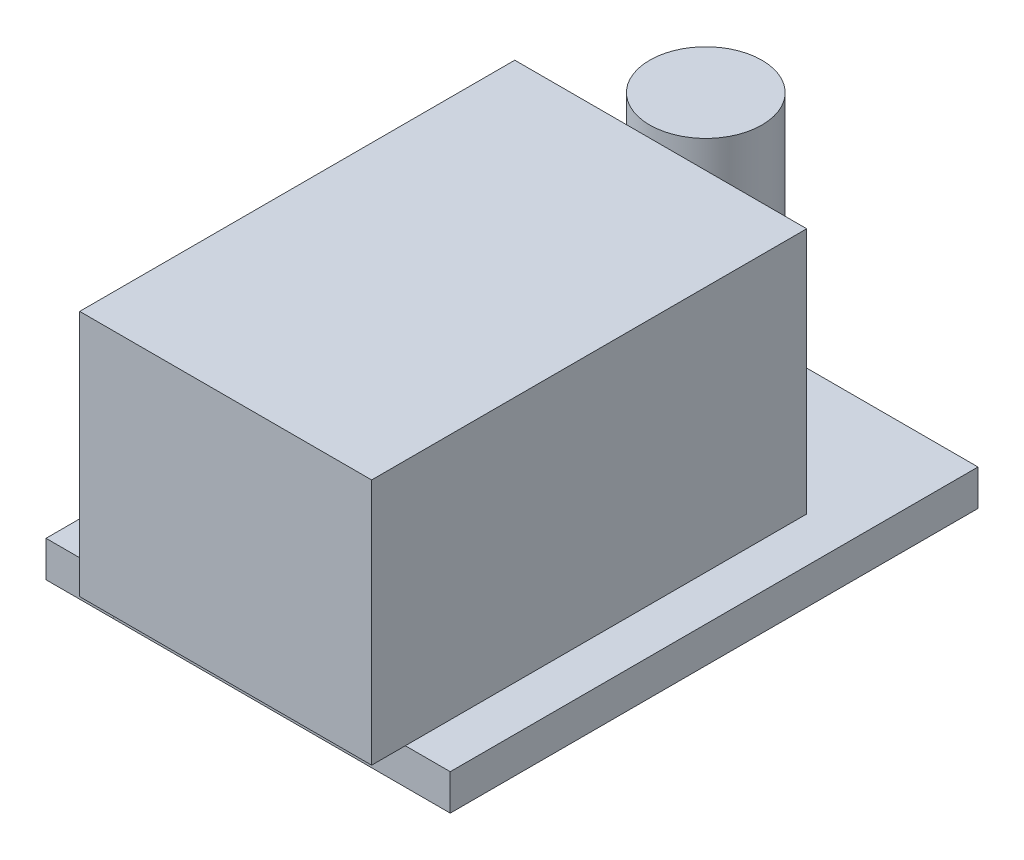
ISO-10303-21;
HEADER;
FILE_DESCRIPTION(('STEP AP214'),'2;1');
FILE_NAME('part.step','',(''),(''),'','','');
FILE_SCHEMA(('AUTOMOTIVE_DESIGN { 1 0 10303 214 1 1 1 1 }'));
ENDSEC;
DATA;
#1=APPLICATION_CONTEXT('core data for automotive mechanical design processes');
#2=APPLICATION_PROTOCOL_DEFINITION('international standard','automotive_design',2000,#1);
#3=PRODUCT_CONTEXT('',#1,'mechanical');
#4=PRODUCT('Part','Part','',(#3));
#5=PRODUCT_RELATED_PRODUCT_CATEGORY('part','',(#4));
#6=PRODUCT_DEFINITION_FORMATION('','',#4);
#7=PRODUCT_DEFINITION_CONTEXT('part definition',#1,'design');
#8=PRODUCT_DEFINITION('design','',#6,#7);
#9=PRODUCT_DEFINITION_SHAPE('','',#8);
#10=(LENGTH_UNIT() NAMED_UNIT(*) SI_UNIT(.MILLI.,.METRE.));
#11=(NAMED_UNIT(*) PLANE_ANGLE_UNIT() SI_UNIT($,.RADIAN.));
#12=(NAMED_UNIT(*) SI_UNIT($,.STERADIAN.) SOLID_ANGLE_UNIT());
#13=UNCERTAINTY_MEASURE_WITH_UNIT(LENGTH_MEASURE(1.E-05),#10,'distance_accuracy_value','');
#14=(GEOMETRIC_REPRESENTATION_CONTEXT(3) GLOBAL_UNCERTAINTY_ASSIGNED_CONTEXT((#13)) GLOBAL_UNIT_ASSIGNED_CONTEXT((#10,
#11,#12)) REPRESENTATION_CONTEXT('',''));
#15=CARTESIAN_POINT('',(0.,0.,0.));
#16=DIRECTION('',(0.,0.,1.));
#17=DIRECTION('',(1.,0.,0.));
#18=AXIS2_PLACEMENT_3D('',#15,#16,#17);
#19=CARTESIAN_POINT('',(0.,-1.6,0.));
#20=DIRECTION('',(0.,-1.,0.));
#21=DIRECTION('',(0.,0.,-1.));
#22=AXIS2_PLACEMENT_3D('',#19,#20,#21);
#23=PLANE('',#22);
#24=DIRECTION('',(0.,0.,-1.));
#25=VECTOR('',#24,1.);
#26=CARTESIAN_POINT('',(-7.5,-1.6,4.25));
#27=LINE('',#26,#25);
#28=CARTESIAN_POINT('',(-7.5,-1.6,11.75));
#29=VERTEX_POINT('',#28);
#30=CARTESIAN_POINT('',(-7.5,-1.6,4.25));
#31=VERTEX_POINT('',#30);
#32=EDGE_CURVE('E54',#29,#31,#27,.T.);
#33=ORIENTED_EDGE('',*,*,#32,.F.);
#34=DIRECTION('',(1.,0.,0.));
#35=VECTOR('',#34,1.);
#36=CARTESIAN_POINT('',(-7.5,-1.6,11.75));
#37=LINE('',#36,#35);
#38=CARTESIAN_POINT('',(-10.5,-1.6,11.75));
#39=VERTEX_POINT('',#38);
#40=EDGE_CURVE('E77',#39,#29,#37,.T.);
#41=ORIENTED_EDGE('',*,*,#40,.F.);
#42=DIRECTION('',(0.,0.,1.));
#43=VECTOR('',#42,1.);
#44=CARTESIAN_POINT('',(-10.5,-1.6,4.25));
#45=LINE('',#44,#43);
#46=CARTESIAN_POINT('',(-10.5,-1.6,4.25));
#47=VERTEX_POINT('',#46);
#48=EDGE_CURVE('E82',#47,#39,#45,.T.);
#49=ORIENTED_EDGE('',*,*,#48,.F.);
#50=DIRECTION('',(-1.,0.,0.));
#51=VECTOR('',#50,1.);
#52=CARTESIAN_POINT('',(-7.5,-1.6,4.25));
#53=LINE('',#52,#51);
#54=EDGE_CURVE('E97',#31,#47,#53,.T.);
#55=ORIENTED_EDGE('',*,*,#54,.F.);
#56=EDGE_LOOP('',(#33,#41,#49,#55));
#57=FACE_BOUND('',#56,.T.);
#58=ADVANCED_FACE('F46',(#57),#23,.T.);
#59=CARTESIAN_POINT('',(0.,0.,0.));
#60=DIRECTION('',(0.,-1.,0.));
#61=DIRECTION('',(0.,0.,-1.));
#62=AXIS2_PLACEMENT_3D('',#59,#60,#61);
#63=PLANE('',#62);
#64=DIRECTION('',(0.,0.,-1.));
#65=VECTOR('',#64,1.);
#66=CARTESIAN_POINT('',(-7.5,0.,4.25));
#67=LINE('',#66,#65);
#68=CARTESIAN_POINT('',(-7.5,0.,11.75));
#69=VERTEX_POINT('',#68);
#70=CARTESIAN_POINT('',(-7.5,0.,4.25));
#71=VERTEX_POINT('',#70);
#72=EDGE_CURVE('E106',#69,#71,#67,.T.);
#73=ORIENTED_EDGE('',*,*,#72,.T.);
#74=DIRECTION('',(-1.,0.,0.));
#75=VECTOR('',#74,1.);
#76=CARTESIAN_POINT('',(-7.5,0.,4.25));
#77=LINE('',#76,#75);
#78=CARTESIAN_POINT('',(-10.5,0.,4.25));
#79=VERTEX_POINT('',#78);
#80=EDGE_CURVE('E95',#71,#79,#77,.T.);
#81=ORIENTED_EDGE('',*,*,#80,.T.);
#82=DIRECTION('',(0.,0.,1.));
#83=VECTOR('',#82,1.);
#84=CARTESIAN_POINT('',(-10.5,0.,4.25));
#85=LINE('',#84,#83);
#86=CARTESIAN_POINT('',(-10.5,0.,11.75));
#87=VERTEX_POINT('',#86);
#88=EDGE_CURVE('E98',#79,#87,#85,.T.);
#89=ORIENTED_EDGE('',*,*,#88,.T.);
#90=DIRECTION('',(1.,0.,0.));
#91=VECTOR('',#90,1.);
#92=CARTESIAN_POINT('',(-7.5,0.,11.75));
#93=LINE('',#92,#91);
#94=EDGE_CURVE('E103',#87,#69,#93,.T.);
#95=ORIENTED_EDGE('',*,*,#94,.T.);
#96=EDGE_LOOP('',(#73,#81,#89,#95));
#97=FACE_BOUND('',#96,.T.);
#98=ADVANCED_FACE('F105',(#97),#63,.F.);
#99=CARTESIAN_POINT('',(-7.5,-9.67774721070175,4.25));
#100=DIRECTION('',(0.,0.,-1.));
#101=DIRECTION('',(-1.,0.,0.));
#102=AXIS2_PLACEMENT_3D('',#99,#100,#101);
#103=PLANE('',#102);
#104=DIRECTION('',(0.,1.,0.));
#105=VECTOR('',#104,1.);
#106=CARTESIAN_POINT('',(-7.5,-9.67774721070175,4.25));
#107=LINE('',#106,#105);
#108=EDGE_CURVE('E12',#31,#71,#107,.T.);
#109=ORIENTED_EDGE('',*,*,#108,.F.);
#110=ORIENTED_EDGE('',*,*,#54,.T.);
#111=DIRECTION('',(0.,1.,0.));
#112=VECTOR('',#111,1.);
#113=CARTESIAN_POINT('',(-10.5,-9.67774721070175,4.25));
#114=LINE('',#113,#112);
#115=EDGE_CURVE('E92',#47,#79,#114,.T.);
#116=ORIENTED_EDGE('',*,*,#115,.T.);
#117=ORIENTED_EDGE('',*,*,#80,.F.);
#118=EDGE_LOOP('',(#109,#110,#116,#117));
#119=FACE_BOUND('',#118,.T.);
#120=ADVANCED_FACE('F93',(#119),#103,.T.);
#121=CARTESIAN_POINT('',(-10.5,-9.67774721070175,4.25));
#122=DIRECTION('',(-1.,0.,0.));
#123=DIRECTION('',(0.,0.,1.));
#124=AXIS2_PLACEMENT_3D('',#121,#122,#123);
#125=PLANE('',#124);
#126=ORIENTED_EDGE('',*,*,#115,.F.);
#127=ORIENTED_EDGE('',*,*,#48,.T.);
#128=DIRECTION('',(0.,1.,0.));
#129=VECTOR('',#128,1.);
#130=CARTESIAN_POINT('',(-10.5,-9.67774721070175,11.75));
#131=LINE('',#130,#129);
#132=EDGE_CURVE('E87',#39,#87,#131,.T.);
#133=ORIENTED_EDGE('',*,*,#132,.T.);
#134=ORIENTED_EDGE('',*,*,#88,.F.);
#135=EDGE_LOOP('',(#126,#127,#133,#134));
#136=FACE_BOUND('',#135,.T.);
#137=ADVANCED_FACE('F99',(#136),#125,.T.);
#138=CARTESIAN_POINT('',(-7.5,-9.67774721070175,11.75));
#139=DIRECTION('',(0.,0.,1.));
#140=DIRECTION('',(1.,0.,0.));
#141=AXIS2_PLACEMENT_3D('',#138,#139,#140);
#142=PLANE('',#141);
#143=ORIENTED_EDGE('',*,*,#132,.F.);
#144=ORIENTED_EDGE('',*,*,#40,.T.);
#145=DIRECTION('',(0.,1.,0.));
#146=VECTOR('',#145,1.);
#147=CARTESIAN_POINT('',(-7.5,-9.67774721070175,11.75));
#148=LINE('',#147,#146);
#149=EDGE_CURVE('E113',#29,#69,#148,.T.);
#150=ORIENTED_EDGE('',*,*,#149,.T.);
#151=ORIENTED_EDGE('',*,*,#94,.F.);
#152=EDGE_LOOP('',(#143,#144,#150,#151));
#153=FACE_BOUND('',#152,.T.);
#154=ADVANCED_FACE('F119',(#153),#142,.T.);
#155=CARTESIAN_POINT('',(-7.5,-9.67774721070175,4.25));
#156=DIRECTION('',(1.,0.,0.));
#157=DIRECTION('',(0.,0.,-1.));
#158=AXIS2_PLACEMENT_3D('',#155,#156,#157);
#159=PLANE('',#158);
#160=ORIENTED_EDGE('',*,*,#149,.F.);
#161=ORIENTED_EDGE('',*,*,#32,.T.);
#162=ORIENTED_EDGE('',*,*,#108,.T.);
#163=ORIENTED_EDGE('',*,*,#72,.F.);
#164=EDGE_LOOP('',(#160,#161,#162,#163));
#165=FACE_BOUND('',#164,.T.);
#166=ADVANCED_FACE('F120',(#165),#159,.T.);
#167=CLOSED_SHELL('',(#58,#98,#120,#137,#154,#166));
#168=MANIFOLD_SOLID_BREP('B2',#167);
#169=CARTESIAN_POINT('',(0.,-1.6,0.));
#170=DIRECTION('',(0.,-1.,0.));
#171=DIRECTION('',(0.,0.,-1.));
#172=AXIS2_PLACEMENT_3D('',#169,#170,#171);
#173=PLANE('',#172);
#174=DIRECTION('',(0.,0.,-1.));
#175=VECTOR('',#174,1.);
#176=CARTESIAN_POINT('',(-7.5,-1.6,-10.85));
#177=LINE('',#176,#175);
#178=CARTESIAN_POINT('',(-7.5,-1.6,-6.35));
#179=VERTEX_POINT('',#178);
#180=CARTESIAN_POINT('',(-7.5,-1.6,-10.85));
#181=VERTEX_POINT('',#180);
#182=EDGE_CURVE('E187',#179,#181,#177,.T.);
#183=ORIENTED_EDGE('',*,*,#182,.F.);
#184=DIRECTION('',(1.,0.,0.));
#185=VECTOR('',#184,1.);
#186=CARTESIAN_POINT('',(-7.5,-1.6,-6.35));
#187=LINE('',#186,#185);
#188=CARTESIAN_POINT('',(-10.5,-1.6,-6.35));
#189=VERTEX_POINT('',#188);
#190=EDGE_CURVE('E210',#189,#179,#187,.T.);
#191=ORIENTED_EDGE('',*,*,#190,.F.);
#192=DIRECTION('',(0.,0.,1.));
#193=VECTOR('',#192,1.);
#194=CARTESIAN_POINT('',(-10.5,-1.6,-10.85));
#195=LINE('',#194,#193);
#196=CARTESIAN_POINT('',(-10.5,-1.6,-10.85));
#197=VERTEX_POINT('',#196);
#198=EDGE_CURVE('E215',#197,#189,#195,.T.);
#199=ORIENTED_EDGE('',*,*,#198,.F.);
#200=DIRECTION('',(-1.,0.,0.));
#201=VECTOR('',#200,1.);
#202=CARTESIAN_POINT('',(-7.5,-1.6,-10.85));
#203=LINE('',#202,#201);
#204=EDGE_CURVE('E230',#181,#197,#203,.T.);
#205=ORIENTED_EDGE('',*,*,#204,.F.);
#206=EDGE_LOOP('',(#183,#191,#199,#205));
#207=FACE_BOUND('',#206,.T.);
#208=ADVANCED_FACE('F179',(#207),#173,.T.);
#209=CARTESIAN_POINT('',(0.,0.,0.));
#210=DIRECTION('',(0.,-1.,0.));
#211=DIRECTION('',(0.,0.,-1.));
#212=AXIS2_PLACEMENT_3D('',#209,#210,#211);
#213=PLANE('',#212);
#214=DIRECTION('',(0.,0.,-1.));
#215=VECTOR('',#214,1.);
#216=CARTESIAN_POINT('',(-7.5,0.,-10.85));
#217=LINE('',#216,#215);
#218=CARTESIAN_POINT('',(-7.5,0.,-6.35));
#219=VERTEX_POINT('',#218);
#220=CARTESIAN_POINT('',(-7.5,0.,-10.85));
#221=VERTEX_POINT('',#220);
#222=EDGE_CURVE('E239',#219,#221,#217,.T.);
#223=ORIENTED_EDGE('',*,*,#222,.T.);
#224=DIRECTION('',(-1.,0.,0.));
#225=VECTOR('',#224,1.);
#226=CARTESIAN_POINT('',(-7.5,0.,-10.85));
#227=LINE('',#226,#225);
#228=CARTESIAN_POINT('',(-10.5,0.,-10.85));
#229=VERTEX_POINT('',#228);
#230=EDGE_CURVE('E228',#221,#229,#227,.T.);
#231=ORIENTED_EDGE('',*,*,#230,.T.);
#232=DIRECTION('',(0.,0.,1.));
#233=VECTOR('',#232,1.);
#234=CARTESIAN_POINT('',(-10.5,0.,-10.85));
#235=LINE('',#234,#233);
#236=CARTESIAN_POINT('',(-10.5,0.,-6.35));
#237=VERTEX_POINT('',#236);
#238=EDGE_CURVE('E231',#229,#237,#235,.T.);
#239=ORIENTED_EDGE('',*,*,#238,.T.);
#240=DIRECTION('',(1.,0.,0.));
#241=VECTOR('',#240,1.);
#242=CARTESIAN_POINT('',(-7.5,0.,-6.35));
#243=LINE('',#242,#241);
#244=EDGE_CURVE('E236',#237,#219,#243,.T.);
#245=ORIENTED_EDGE('',*,*,#244,.T.);
#246=EDGE_LOOP('',(#223,#231,#239,#245));
#247=FACE_BOUND('',#246,.T.);
#248=ADVANCED_FACE('F238',(#247),#213,.F.);
#249=CARTESIAN_POINT('',(-7.5,-9.67774721070175,-10.85));
#250=DIRECTION('',(0.,0.,-1.));
#251=DIRECTION('',(-1.,0.,0.));
#252=AXIS2_PLACEMENT_3D('',#249,#250,#251);
#253=PLANE('',#252);
#254=DIRECTION('',(0.,1.,0.));
#255=VECTOR('',#254,1.);
#256=CARTESIAN_POINT('',(-7.5,-9.67774721070175,-10.85));
#257=LINE('',#256,#255);
#258=EDGE_CURVE('E44',#181,#221,#257,.T.);
#259=ORIENTED_EDGE('',*,*,#258,.F.);
#260=ORIENTED_EDGE('',*,*,#204,.T.);
#261=DIRECTION('',(0.,1.,0.));
#262=VECTOR('',#261,1.);
#263=CARTESIAN_POINT('',(-10.5,-9.67774721070175,-10.85));
#264=LINE('',#263,#262);
#265=EDGE_CURVE('E225',#197,#229,#264,.T.);
#266=ORIENTED_EDGE('',*,*,#265,.T.);
#267=ORIENTED_EDGE('',*,*,#230,.F.);
#268=EDGE_LOOP('',(#259,#260,#266,#267));
#269=FACE_BOUND('',#268,.T.);
#270=ADVANCED_FACE('F226',(#269),#253,.T.);
#271=CARTESIAN_POINT('',(-10.5,-9.67774721070175,-10.85));
#272=DIRECTION('',(-1.,0.,0.));
#273=DIRECTION('',(0.,0.,1.));
#274=AXIS2_PLACEMENT_3D('',#271,#272,#273);
#275=PLANE('',#274);
#276=ORIENTED_EDGE('',*,*,#265,.F.);
#277=ORIENTED_EDGE('',*,*,#198,.T.);
#278=DIRECTION('',(0.,1.,0.));
#279=VECTOR('',#278,1.);
#280=CARTESIAN_POINT('',(-10.5,-9.67774721070175,-6.35));
#281=LINE('',#280,#279);
#282=EDGE_CURVE('E220',#189,#237,#281,.T.);
#283=ORIENTED_EDGE('',*,*,#282,.T.);
#284=ORIENTED_EDGE('',*,*,#238,.F.);
#285=EDGE_LOOP('',(#276,#277,#283,#284));
#286=FACE_BOUND('',#285,.T.);
#287=ADVANCED_FACE('F232',(#286),#275,.T.);
#288=CARTESIAN_POINT('',(-7.5,-9.67774721070175,-6.35));
#289=DIRECTION('',(0.,0.,1.));
#290=DIRECTION('',(1.,0.,0.));
#291=AXIS2_PLACEMENT_3D('',#288,#289,#290);
#292=PLANE('',#291);
#293=ORIENTED_EDGE('',*,*,#282,.F.);
#294=ORIENTED_EDGE('',*,*,#190,.T.);
#295=DIRECTION('',(0.,1.,0.));
#296=VECTOR('',#295,1.);
#297=CARTESIAN_POINT('',(-7.5,-9.67774721070175,-6.35));
#298=LINE('',#297,#296);
#299=EDGE_CURVE('E246',#179,#219,#298,.T.);
#300=ORIENTED_EDGE('',*,*,#299,.T.);
#301=ORIENTED_EDGE('',*,*,#244,.F.);
#302=EDGE_LOOP('',(#293,#294,#300,#301));
#303=FACE_BOUND('',#302,.T.);
#304=ADVANCED_FACE('F252',(#303),#292,.T.);
#305=CARTESIAN_POINT('',(-7.5,-9.67774721070175,-10.85));
#306=DIRECTION('',(1.,0.,0.));
#307=DIRECTION('',(0.,0.,-1.));
#308=AXIS2_PLACEMENT_3D('',#305,#306,#307);
#309=PLANE('',#308);
#310=ORIENTED_EDGE('',*,*,#299,.F.);
#311=ORIENTED_EDGE('',*,*,#182,.T.);
#312=ORIENTED_EDGE('',*,*,#258,.T.);
#313=ORIENTED_EDGE('',*,*,#222,.F.);
#314=EDGE_LOOP('',(#310,#311,#312,#313));
#315=FACE_BOUND('',#314,.T.);
#316=ADVANCED_FACE('F253',(#315),#309,.T.);
#317=CLOSED_SHELL('',(#208,#248,#270,#287,#304,#316));
#318=MANIFOLD_SOLID_BREP('B6',#317);
#319=CARTESIAN_POINT('',(0.,0.,0.));
#320=DIRECTION('',(0.,-1.,0.));
#321=DIRECTION('',(0.,0.,-1.));
#322=AXIS2_PLACEMENT_3D('',#319,#320,#321);
#323=PLANE('',#322);
#324=CARTESIAN_POINT('',(-1.99707729388541,0.,-9.12718520474696));
#325=DIRECTION('',(0.,-1.,0.));
#326=DIRECTION('',(0.,0.,-1.));
#327=AXIS2_PLACEMENT_3D('',#324,#325,#326);
#328=CIRCLE('',#327,2.5);
#329=CARTESIAN_POINT('',(-1.99707729388541,0.,-11.627185204747));
#330=VERTEX_POINT('',#329);
#331=EDGE_CURVE('E177',#330,#330,#328,.F.);
#332=ORIENTED_EDGE('',*,*,#331,.F.);
#333=EDGE_LOOP('',(#332));
#334=FACE_BOUND('',#333,.T.);
#335=DIRECTION('',(-1.,0.,0.));
#336=VECTOR('',#335,1.);
#337=CARTESIAN_POINT('',(-7.5,0.,-6.12356921616279));
#338=LINE('',#337,#336);
#339=CARTESIAN_POINT('',(5.5,0.,-6.12356921616279));
#340=VERTEX_POINT('',#339);
#341=CARTESIAN_POINT('',(-7.5,0.,-6.1235692161628));
#342=VERTEX_POINT('',#341);
#343=EDGE_CURVE('E389',#340,#342,#338,.T.);
#344=ORIENTED_EDGE('',*,*,#343,.F.);
#345=DIRECTION('',(0.,0.,-1.));
#346=VECTOR('',#345,1.);
#347=CARTESIAN_POINT('',(5.5,0.,13.25));
#348=LINE('',#347,#346);
#349=CARTESIAN_POINT('',(5.5,0.,11.75));
#350=VERTEX_POINT('',#349);
#351=EDGE_CURVE('E311',#350,#340,#348,.T.);
#352=ORIENTED_EDGE('',*,*,#351,.F.);
#353=DIRECTION('',(1.,0.,0.));
#354=VECTOR('',#353,1.);
#355=CARTESIAN_POINT('',(-7.5,0.,11.75));
#356=LINE('',#355,#354);
#357=CARTESIAN_POINT('',(7.5,0.,11.75));
#358=VERTEX_POINT('',#357);
#359=EDGE_CURVE('E395',#350,#358,#356,.T.);
#360=ORIENTED_EDGE('',*,*,#359,.T.);
#361=DIRECTION('',(0.,0.,-1.));
#362=VECTOR('',#361,1.);
#363=CARTESIAN_POINT('',(7.5,0.,11.75));
#364=LINE('',#363,#362);
#365=CARTESIAN_POINT('',(7.5,0.,-11.75));
#366=VERTEX_POINT('',#365);
#367=EDGE_CURVE('E418',#358,#366,#364,.T.);
#368=ORIENTED_EDGE('',*,*,#367,.T.);
#369=DIRECTION('',(-1.,0.,0.));
#370=VECTOR('',#369,1.);
#371=CARTESIAN_POINT('',(-7.5,0.,-11.75));
#372=LINE('',#371,#370);
#373=CARTESIAN_POINT('',(-7.5,0.,-11.75));
#374=VERTEX_POINT('',#373);
#375=EDGE_CURVE('E405',#366,#374,#372,.T.);
#376=ORIENTED_EDGE('',*,*,#375,.T.);
#377=DIRECTION('',(0.,0.,1.));
#378=VECTOR('',#377,1.);
#379=CARTESIAN_POINT('',(-7.5,0.,11.75));
#380=LINE('',#379,#378);
#381=EDGE_CURVE('E323',#374,#342,#380,.T.);
#382=ORIENTED_EDGE('',*,*,#381,.T.);
#383=EDGE_LOOP('',(#344,#352,#360,#368,#376,#382));
#384=FACE_BOUND('',#383,.T.);
#385=ADVANCED_FACE('F303',(#334,#384),#323,.F.);
#386=CARTESIAN_POINT('',(-7.5,-1.6,11.75));
#387=DIRECTION('',(-1.,0.,0.));
#388=DIRECTION('',(0.,0.,1.));
#389=AXIS2_PLACEMENT_3D('',#386,#387,#388);
#390=PLANE('',#389);
#391=ORIENTED_EDGE('',*,*,#381,.F.);
#392=DIRECTION('',(0.,1.,0.));
#393=VECTOR('',#392,1.);
#394=CARTESIAN_POINT('',(-7.5,-1.6,-11.75));
#395=LINE('',#394,#393);
#396=CARTESIAN_POINT('',(-7.5,-1.6,-11.75));
#397=VERTEX_POINT('',#396);
#398=EDGE_CURVE('E422',#397,#374,#395,.T.);
#399=ORIENTED_EDGE('',*,*,#398,.F.);
#400=DIRECTION('',(0.,0.,1.));
#401=VECTOR('',#400,1.);
#402=CARTESIAN_POINT('',(-7.5,-1.6,11.75));
#403=LINE('',#402,#401);
#404=CARTESIAN_POINT('',(-7.5,-1.6,11.75));
#405=VERTEX_POINT('',#404);
#406=EDGE_CURVE('E401',#397,#405,#403,.T.);
#407=ORIENTED_EDGE('',*,*,#406,.T.);
#408=DIRECTION('',(0.,1.,0.));
#409=VECTOR('',#408,1.);
#410=CARTESIAN_POINT('',(-7.5,-1.6,11.75));
#411=LINE('',#410,#409);
#412=CARTESIAN_POINT('',(-7.5,0.,11.75));
#413=VERTEX_POINT('',#412);
#414=EDGE_CURVE('E413',#405,#413,#411,.T.);
#415=ORIENTED_EDGE('',*,*,#414,.T.);
#416=DIRECTION('',(0.,0.,1.));
#417=VECTOR('',#416,1.);
#418=CARTESIAN_POINT('',(-7.5,0.,13.25));
#419=LINE('',#418,#417);
#420=CARTESIAN_POINT('',(-7.5,0.,13.25));
#421=VERTEX_POINT('',#420);
#422=EDGE_CURVE('E392',#413,#421,#419,.T.);
#423=ORIENTED_EDGE('',*,*,#422,.T.);
#424=DIRECTION('',(0.,-1.,0.));
#425=VECTOR('',#424,1.);
#426=CARTESIAN_POINT('',(-7.5,11.,13.25));
#427=LINE('',#426,#425);
#428=CARTESIAN_POINT('',(-7.5,11.,13.25));
#429=VERTEX_POINT('',#428);
#430=EDGE_CURVE('E374',#429,#421,#427,.T.);
#431=ORIENTED_EDGE('',*,*,#430,.F.);
#432=DIRECTION('',(0.,0.,1.));
#433=VECTOR('',#432,1.);
#434=CARTESIAN_POINT('',(-7.5,11.,13.25));
#435=LINE('',#434,#433);
#436=CARTESIAN_POINT('',(-7.5,11.,-6.12356921616279));
#437=VERTEX_POINT('',#436);
#438=EDGE_CURVE('E380',#437,#429,#435,.T.);
#439=ORIENTED_EDGE('',*,*,#438,.F.);
#440=DIRECTION('',(0.,-1.,0.));
#441=VECTOR('',#440,1.);
#442=CARTESIAN_POINT('',(-7.5,11.,-6.12356921616279));
#443=LINE('',#442,#441);
#444=EDGE_CURVE('E449',#437,#342,#443,.T.);
#445=ORIENTED_EDGE('',*,*,#444,.T.);
#446=EDGE_LOOP('',(#391,#399,#407,#415,#423,#431,#439,#445));
#447=FACE_BOUND('',#446,.T.);
#448=ADVANCED_FACE('F305',(#447),#390,.T.);
#449=CARTESIAN_POINT('',(-7.5,-1.6,-11.75));
#450=DIRECTION('',(0.,0.,-1.));
#451=DIRECTION('',(-1.,0.,0.));
#452=AXIS2_PLACEMENT_3D('',#449,#450,#451);
#453=PLANE('',#452);
#454=ORIENTED_EDGE('',*,*,#375,.F.);
#455=DIRECTION('',(0.,1.,0.));
#456=VECTOR('',#455,1.);
#457=CARTESIAN_POINT('',(7.5,-1.6,-11.75));
#458=LINE('',#457,#456);
#459=CARTESIAN_POINT('',(7.5,-1.6,-11.75));
#460=VERTEX_POINT('',#459);
#461=EDGE_CURVE('E424',#460,#366,#458,.T.);
#462=ORIENTED_EDGE('',*,*,#461,.F.);
#463=DIRECTION('',(-1.,0.,0.));
#464=VECTOR('',#463,1.);
#465=CARTESIAN_POINT('',(-7.5,-1.6,-11.75));
#466=LINE('',#465,#464);
#467=EDGE_CURVE('E411',#460,#397,#466,.T.);
#468=ORIENTED_EDGE('',*,*,#467,.T.);
#469=ORIENTED_EDGE('',*,*,#398,.T.);
#470=EDGE_LOOP('',(#454,#462,#468,#469));
#471=FACE_BOUND('',#470,.T.);
#472=ADVANCED_FACE('F471',(#471),#453,.T.);
#473=CARTESIAN_POINT('',(7.5,-1.6,11.75));
#474=DIRECTION('',(1.,0.,0.));
#475=DIRECTION('',(0.,0.,-1.));
#476=AXIS2_PLACEMENT_3D('',#473,#474,#475);
#477=PLANE('',#476);
#478=ORIENTED_EDGE('',*,*,#367,.F.);
#479=DIRECTION('',(0.,1.,0.));
#480=VECTOR('',#479,1.);
#481=CARTESIAN_POINT('',(7.5,-1.6,11.75));
#482=LINE('',#481,#480);
#483=CARTESIAN_POINT('',(7.5,-1.6,11.75));
#484=VERTEX_POINT('',#483);
#485=EDGE_CURVE('E426',#484,#358,#482,.T.);
#486=ORIENTED_EDGE('',*,*,#485,.F.);
#487=DIRECTION('',(0.,0.,-1.));
#488=VECTOR('',#487,1.);
#489=CARTESIAN_POINT('',(7.5,-1.6,11.75));
#490=LINE('',#489,#488);
#491=EDGE_CURVE('E408',#484,#460,#490,.T.);
#492=ORIENTED_EDGE('',*,*,#491,.T.);
#493=ORIENTED_EDGE('',*,*,#461,.T.);
#494=EDGE_LOOP('',(#478,#486,#492,#493));
#495=FACE_BOUND('',#494,.T.);
#496=ADVANCED_FACE('F477',(#495),#477,.T.);
#497=CARTESIAN_POINT('',(-7.5,-1.6,11.75));
#498=DIRECTION('',(0.,0.,1.));
#499=DIRECTION('',(1.,0.,0.));
#500=AXIS2_PLACEMENT_3D('',#497,#498,#499);
#501=PLANE('',#500);
#502=EDGE_CURVE('E415',#413,#350,#356,.T.);
#503=ORIENTED_EDGE('',*,*,#502,.F.);
#504=ORIENTED_EDGE('',*,*,#414,.F.);
#505=DIRECTION('',(1.,0.,0.));
#506=VECTOR('',#505,1.);
#507=CARTESIAN_POINT('',(-7.5,-1.6,11.75));
#508=LINE('',#507,#506);
#509=EDGE_CURVE('E404',#405,#484,#508,.T.);
#510=ORIENTED_EDGE('',*,*,#509,.T.);
#511=ORIENTED_EDGE('',*,*,#485,.T.);
#512=ORIENTED_EDGE('',*,*,#359,.F.);
#513=EDGE_LOOP('',(#503,#504,#510,#511,#512));
#514=FACE_BOUND('',#513,.T.);
#515=ADVANCED_FACE('F432',(#514),#501,.T.);
#516=CARTESIAN_POINT('',(0.,-1.6,0.));
#517=DIRECTION('',(0.,-1.,0.));
#518=DIRECTION('',(0.,0.,-1.));
#519=AXIS2_PLACEMENT_3D('',#516,#517,#518);
#520=PLANE('',#519);
#521=ORIENTED_EDGE('',*,*,#406,.F.);
#522=ORIENTED_EDGE('',*,*,#467,.F.);
#523=ORIENTED_EDGE('',*,*,#491,.F.);
#524=ORIENTED_EDGE('',*,*,#509,.F.);
#525=EDGE_LOOP('',(#521,#522,#523,#524));
#526=FACE_BOUND('',#525,.T.);
#527=ADVANCED_FACE('F463',(#526),#520,.T.);
#528=CARTESIAN_POINT('',(-7.5,11.,13.25));
#529=DIRECTION('',(0.,0.,-1.));
#530=DIRECTION('',(-1.,0.,0.));
#531=AXIS2_PLACEMENT_3D('',#528,#529,#530);
#532=PLANE('',#531);
#533=DIRECTION('',(1.,0.,0.));
#534=VECTOR('',#533,1.);
#535=CARTESIAN_POINT('',(-7.5,0.,13.25));
#536=LINE('',#535,#534);
#537=CARTESIAN_POINT('',(5.5,0.,13.25));
#538=VERTEX_POINT('',#537);
#539=EDGE_CURVE('E437',#421,#538,#536,.T.);
#540=ORIENTED_EDGE('',*,*,#539,.T.);
#541=DIRECTION('',(0.,-1.,0.));
#542=VECTOR('',#541,1.);
#543=CARTESIAN_POINT('',(5.5,11.,13.25));
#544=LINE('',#543,#542);
#545=CARTESIAN_POINT('',(5.5,11.,13.25));
#546=VERTEX_POINT('',#545);
#547=EDGE_CURVE('E376',#546,#538,#544,.T.);
#548=ORIENTED_EDGE('',*,*,#547,.F.);
#549=DIRECTION('',(1.,0.,0.));
#550=VECTOR('',#549,1.);
#551=CARTESIAN_POINT('',(-7.5,11.,13.25));
#552=LINE('',#551,#550);
#553=EDGE_CURVE('E370',#429,#546,#552,.T.);
#554=ORIENTED_EDGE('',*,*,#553,.F.);
#555=ORIENTED_EDGE('',*,*,#430,.T.);
#556=EDGE_LOOP('',(#540,#548,#554,#555));
#557=FACE_BOUND('',#556,.T.);
#558=ADVANCED_FACE('F372',(#557),#532,.F.);
#559=CARTESIAN_POINT('',(5.5,11.,13.25));
#560=DIRECTION('',(-1.,0.,0.));
#561=DIRECTION('',(0.,0.,1.));
#562=AXIS2_PLACEMENT_3D('',#559,#560,#561);
#563=PLANE('',#562);
#564=EDGE_CURVE('E440',#538,#350,#348,.T.);
#565=ORIENTED_EDGE('',*,*,#564,.T.);
#566=ORIENTED_EDGE('',*,*,#351,.T.);
#567=DIRECTION('',(0.,-1.,0.));
#568=VECTOR('',#567,1.);
#569=CARTESIAN_POINT('',(5.5,11.,-6.12356921616279));
#570=LINE('',#569,#568);
#571=CARTESIAN_POINT('',(5.5,11.,-6.12356921616279));
#572=VERTEX_POINT('',#571);
#573=EDGE_CURVE('E397',#572,#340,#570,.T.);
#574=ORIENTED_EDGE('',*,*,#573,.F.);
#575=DIRECTION('',(0.,0.,-1.));
#576=VECTOR('',#575,1.);
#577=CARTESIAN_POINT('',(5.5,11.,13.25));
#578=LINE('',#577,#576);
#579=EDGE_CURVE('E379',#546,#572,#578,.T.);
#580=ORIENTED_EDGE('',*,*,#579,.F.);
#581=ORIENTED_EDGE('',*,*,#547,.T.);
#582=EDGE_LOOP('',(#565,#566,#574,#580,#581));
#583=FACE_BOUND('',#582,.T.);
#584=ADVANCED_FACE('F455',(#583),#563,.F.);
#585=CARTESIAN_POINT('',(-7.5,11.,-6.12356921616279));
#586=DIRECTION('',(0.,0.,1.));
#587=DIRECTION('',(1.,0.,0.));
#588=AXIS2_PLACEMENT_3D('',#585,#586,#587);
#589=PLANE('',#588);
#590=ORIENTED_EDGE('',*,*,#343,.T.);
#591=ORIENTED_EDGE('',*,*,#444,.F.);
#592=DIRECTION('',(-1.,0.,0.));
#593=VECTOR('',#592,1.);
#594=CARTESIAN_POINT('',(-7.5,11.,-6.12356921616279));
#595=LINE('',#594,#593);
#596=EDGE_CURVE('E385',#572,#437,#595,.T.);
#597=ORIENTED_EDGE('',*,*,#596,.F.);
#598=ORIENTED_EDGE('',*,*,#573,.T.);
#599=EDGE_LOOP('',(#590,#591,#597,#598));
#600=FACE_BOUND('',#599,.T.);
#601=ADVANCED_FACE('F453',(#600),#589,.F.);
#602=CARTESIAN_POINT('',(0.,11.,0.));
#603=DIRECTION('',(0.,-1.,0.));
#604=DIRECTION('',(0.,0.,-1.));
#605=AXIS2_PLACEMENT_3D('',#602,#603,#604);
#606=PLANE('',#605);
#607=ORIENTED_EDGE('',*,*,#438,.T.);
#608=ORIENTED_EDGE('',*,*,#553,.T.);
#609=ORIENTED_EDGE('',*,*,#579,.T.);
#610=ORIENTED_EDGE('',*,*,#596,.T.);
#611=EDGE_LOOP('',(#607,#608,#609,#610));
#612=FACE_BOUND('',#611,.T.);
#613=ADVANCED_FACE('F383',(#612),#606,.F.);
#614=CARTESIAN_POINT('',(0.,0.,0.));
#615=DIRECTION('',(0.,-1.,0.));
#616=DIRECTION('',(0.,0.,-1.));
#617=AXIS2_PLACEMENT_3D('',#614,#615,#616);
#618=PLANE('',#617);
#619=ORIENTED_EDGE('',*,*,#422,.F.);
#620=ORIENTED_EDGE('',*,*,#502,.T.);
#621=ORIENTED_EDGE('',*,*,#564,.F.);
#622=ORIENTED_EDGE('',*,*,#539,.F.);
#623=EDGE_LOOP('',(#619,#620,#621,#622));
#624=FACE_BOUND('',#623,.T.);
#625=ADVANCED_FACE('F436',(#624),#618,.T.);
#626=CARTESIAN_POINT('',(-1.99707729388541,11.,-9.12718520474696));
#627=DIRECTION('',(0.,-1.,0.));
#628=DIRECTION('',(0.,0.,-1.));
#629=AXIS2_PLACEMENT_3D('',#626,#627,#628);
#630=CYLINDRICAL_SURFACE('',#629,2.5);
#631=CARTESIAN_POINT('',(-1.99707729388541,11.,-9.12718520474696));
#632=DIRECTION('',(0.,1.,0.));
#633=DIRECTION('',(0.,0.,1.));
#634=AXIS2_PLACEMENT_3D('',#631,#632,#633);
#635=CIRCLE('',#634,2.5);
#636=CARTESIAN_POINT('',(-1.99707729388541,11.,-6.62718520474696));
#637=VERTEX_POINT('',#636);
#638=EDGE_CURVE('E438',#637,#637,#635,.T.);
#639=ORIENTED_EDGE('',*,*,#638,.F.);
#640=EDGE_LOOP('',(#639));
#641=FACE_BOUND('',#640,.T.);
#642=ORIENTED_EDGE('',*,*,#331,.T.);
#643=EDGE_LOOP('',(#642));
#644=FACE_BOUND('',#643,.T.);
#645=ADVANCED_FACE('F528',(#641,#644),#630,.T.);
#646=CARTESIAN_POINT('',(-1.99707729388541,11.,-9.12718520474696));
#647=DIRECTION('',(0.,1.,0.));
#648=DIRECTION('',(0.,0.,1.));
#649=AXIS2_PLACEMENT_3D('',#646,#647,#648);
#650=PLANE('',#649);
#651=ORIENTED_EDGE('',*,*,#638,.T.);
#652=EDGE_LOOP('',(#651));
#653=FACE_BOUND('',#652,.T.);
#654=ADVANCED_FACE('F537',(#653),#650,.T.);
#655=CLOSED_SHELL('',(#385,#448,#472,#496,#515,#527,#558,#584,#601,#613,#625,#645,#654));
#656=MANIFOLD_SOLID_BREP('B38',#655);
#657=ADVANCED_BREP_SHAPE_REPRESENTATION('',(#18,#168,#318,#656),#14);
#658=SHAPE_DEFINITION_REPRESENTATION(#9,#657);
ENDSEC;
END-ISO-10303-21;
